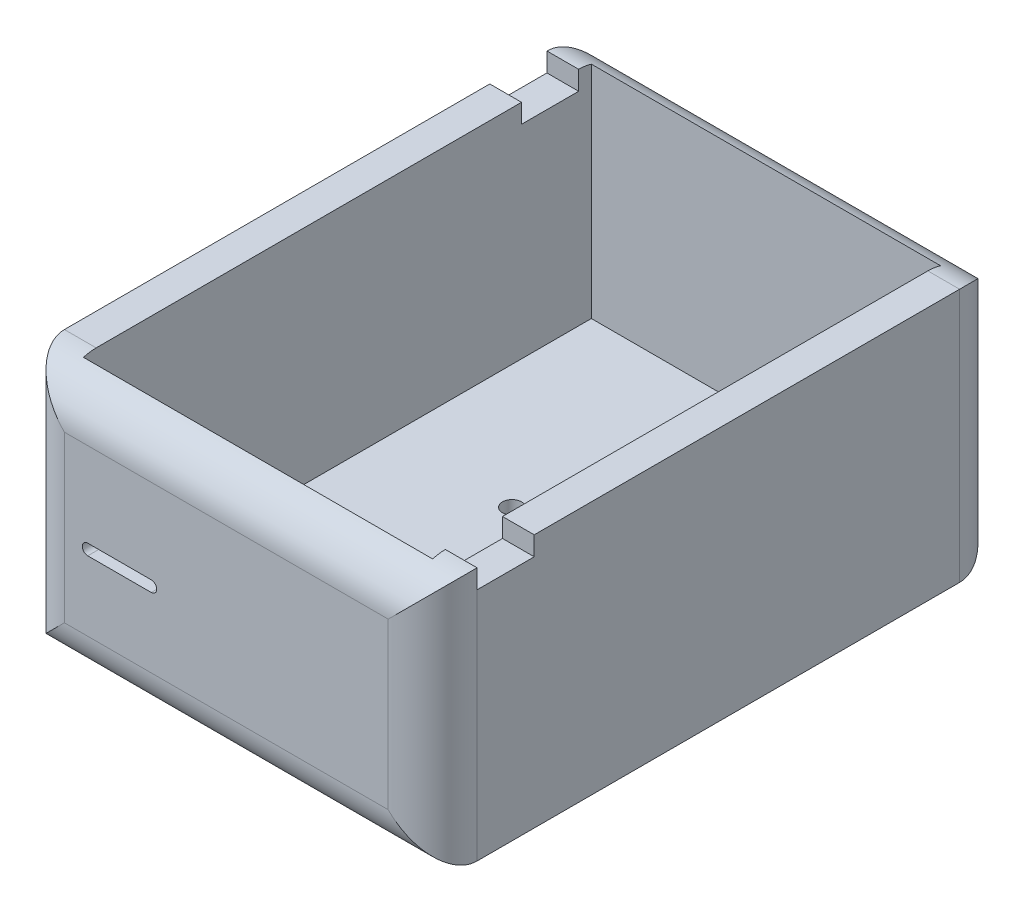
ISO-10303-21;
HEADER;
FILE_DESCRIPTION(('STEP AP214'),'2;1');
FILE_NAME('part.step','',(''),(''),'','','');
FILE_SCHEMA(('AUTOMOTIVE_DESIGN { 1 0 10303 214 1 1 1 1 }'));
ENDSEC;
DATA;
#1=APPLICATION_CONTEXT('core data for automotive mechanical design processes');
#2=APPLICATION_PROTOCOL_DEFINITION('international standard','automotive_design',2000,#1);
#3=PRODUCT_CONTEXT('',#1,'mechanical');
#4=PRODUCT('Part','Part','',(#3));
#5=PRODUCT_RELATED_PRODUCT_CATEGORY('part','',(#4));
#6=PRODUCT_DEFINITION_FORMATION('','',#4);
#7=PRODUCT_DEFINITION_CONTEXT('part definition',#1,'design');
#8=PRODUCT_DEFINITION('design','',#6,#7);
#9=PRODUCT_DEFINITION_SHAPE('','',#8);
#10=(LENGTH_UNIT() NAMED_UNIT(*) SI_UNIT(.MILLI.,.METRE.));
#11=(NAMED_UNIT(*) PLANE_ANGLE_UNIT() SI_UNIT($,.RADIAN.));
#12=(NAMED_UNIT(*) SI_UNIT($,.STERADIAN.) SOLID_ANGLE_UNIT());
#13=UNCERTAINTY_MEASURE_WITH_UNIT(LENGTH_MEASURE(1.E-05),#10,'distance_accuracy_value','');
#14=(GEOMETRIC_REPRESENTATION_CONTEXT(3) GLOBAL_UNCERTAINTY_ASSIGNED_CONTEXT((#13)) GLOBAL_UNIT_ASSIGNED_CONTEXT((#10,
#11,#12)) REPRESENTATION_CONTEXT('',''));
#15=CARTESIAN_POINT('',(0.,0.,0.));
#16=DIRECTION('',(0.,0.,1.));
#17=DIRECTION('',(1.,0.,0.));
#18=AXIS2_PLACEMENT_3D('',#15,#16,#17);
#19=CARTESIAN_POINT('',(0.,40.,0.));
#20=DIRECTION('',(0.,-1.,0.));
#21=DIRECTION('',(0.,0.,-1.));
#22=AXIS2_PLACEMENT_3D('',#19,#20,#21);
#23=PLANE('',#22);
#24=DIRECTION('',(0.,0.,-1.));
#25=VECTOR('',#24,1.);
#26=CARTESIAN_POINT('',(27.5,40.,0.));
#27=LINE('',#26,#25);
#28=CARTESIAN_POINT('',(27.5,40.,29.));
#29=VERTEX_POINT('',#28);
#30=CARTESIAN_POINT('',(27.5,40.,-38.));
#31=VERTEX_POINT('',#30);
#32=EDGE_CURVE('E321',#29,#31,#27,.T.);
#33=ORIENTED_EDGE('',*,*,#32,.F.);
#34=DIRECTION('',(-1.,0.,0.));
#35=VECTOR('',#34,1.);
#36=CARTESIAN_POINT('',(27.5,40.,29.));
#37=LINE('',#36,#35);
#38=CARTESIAN_POINT('',(32.5,40.,29.));
#39=VERTEX_POINT('',#38);
#40=EDGE_CURVE('E233',#39,#29,#37,.T.);
#41=ORIENTED_EDGE('',*,*,#40,.F.);
#42=DIRECTION('',(0.,0.,-1.));
#43=VECTOR('',#42,1.);
#44=CARTESIAN_POINT('',(32.5,40.,45.));
#45=LINE('',#44,#43);
#46=CARTESIAN_POINT('',(32.5,40.,-38.));
#47=VERTEX_POINT('',#46);
#48=EDGE_CURVE('E324',#39,#47,#45,.T.);
#49=ORIENTED_EDGE('',*,*,#48,.T.);
#50=DIRECTION('',(-1.,0.,0.));
#51=VECTOR('',#50,1.);
#52=CARTESIAN_POINT('',(0.,40.,-38.));
#53=LINE('',#52,#51);
#54=EDGE_CURVE('E355',#47,#31,#53,.T.);
#55=ORIENTED_EDGE('',*,*,#54,.T.);
#56=EDGE_LOOP('',(#33,#41,#49,#55));
#57=FACE_BOUND('',#56,.T.);
#58=ADVANCED_FACE('F35',(#57),#23,.F.);
#59=DIRECTION('',(0.,0.,1.));
#60=VECTOR('',#59,1.);
#61=CARTESIAN_POINT('',(-27.5,40.,0.));
#62=LINE('',#61,#60);
#63=CARTESIAN_POINT('',(-27.5,40.,-29.));
#64=VERTEX_POINT('',#63);
#65=CARTESIAN_POINT('',(-27.5,40.,38.));
#66=VERTEX_POINT('',#65);
#67=EDGE_CURVE('E310',#64,#66,#62,.T.);
#68=ORIENTED_EDGE('',*,*,#67,.F.);
#69=DIRECTION('',(1.,0.,0.));
#70=VECTOR('',#69,1.);
#71=CARTESIAN_POINT('',(-32.5,40.,-29.));
#72=LINE('',#71,#70);
#73=CARTESIAN_POINT('',(-32.5,40.,-29.));
#74=VERTEX_POINT('',#73);
#75=EDGE_CURVE('E250',#74,#64,#72,.T.);
#76=ORIENTED_EDGE('',*,*,#75,.F.);
#77=DIRECTION('',(0.,0.,1.));
#78=VECTOR('',#77,1.);
#79=CARTESIAN_POINT('',(-32.5,40.,45.));
#80=LINE('',#79,#78);
#81=CARTESIAN_POINT('',(-32.5,40.,38.));
#82=VERTEX_POINT('',#81);
#83=EDGE_CURVE('E326',#74,#82,#80,.T.);
#84=ORIENTED_EDGE('',*,*,#83,.T.);
#85=DIRECTION('',(1.,0.,0.));
#86=VECTOR('',#85,1.);
#87=CARTESIAN_POINT('',(0.,40.,38.));
#88=LINE('',#87,#86);
#89=EDGE_CURVE('E350',#82,#66,#88,.T.);
#90=ORIENTED_EDGE('',*,*,#89,.T.);
#91=EDGE_LOOP('',(#68,#76,#84,#90));
#92=FACE_BOUND('',#91,.T.);
#93=ADVANCED_FACE('F493',(#92),#23,.F.);
#94=CARTESIAN_POINT('',(32.5,40.,45.));
#95=DIRECTION('',(-1.,0.,0.));
#96=DIRECTION('',(0.,0.,1.));
#97=AXIS2_PLACEMENT_3D('',#94,#95,#96);
#98=PLANE('',#97);
#99=ORIENTED_EDGE('',*,*,#48,.F.);
#100=DIRECTION('',(0.,1.,0.));
#101=VECTOR('',#100,1.);
#102=CARTESIAN_POINT('',(32.5,37.,29.));
#103=LINE('',#102,#101);
#104=CARTESIAN_POINT('',(32.5,37.,29.));
#105=VERTEX_POINT('',#104);
#106=EDGE_CURVE('E251',#105,#39,#103,.T.);
#107=ORIENTED_EDGE('',*,*,#106,.F.);
#108=DIRECTION('',(0.,0.,-1.));
#109=VECTOR('',#108,1.);
#110=CARTESIAN_POINT('',(32.5,37.,38.));
#111=LINE('',#110,#109);
#112=CARTESIAN_POINT('',(32.5,37.,38.));
#113=VERTEX_POINT('',#112);
#114=EDGE_CURVE('E240',#113,#105,#111,.T.);
#115=ORIENTED_EDGE('',*,*,#114,.F.);
#116=DIRECTION('',(0.,-1.,0.));
#117=VECTOR('',#116,1.);
#118=CARTESIAN_POINT('',(32.5,40.,38.));
#119=LINE('',#118,#117);
#120=CARTESIAN_POINT('',(32.5,0.,38.));
#121=VERTEX_POINT('',#120);
#122=EDGE_CURVE('E342',#113,#121,#119,.T.);
#123=ORIENTED_EDGE('',*,*,#122,.T.);
#124=DIRECTION('',(0.,0.,-1.));
#125=VECTOR('',#124,1.);
#126=CARTESIAN_POINT('',(32.5,0.,45.));
#127=LINE('',#126,#125);
#128=CARTESIAN_POINT('',(32.5,0.,-38.));
#129=VERTEX_POINT('',#128);
#130=EDGE_CURVE('E305',#121,#129,#127,.T.);
#131=ORIENTED_EDGE('',*,*,#130,.T.);
#132=DIRECTION('',(0.,-1.,0.));
#133=VECTOR('',#132,1.);
#134=CARTESIAN_POINT('',(32.5,40.,-38.));
#135=LINE('',#134,#133);
#136=EDGE_CURVE('E345',#129,#47,#135,.F.);
#137=ORIENTED_EDGE('',*,*,#136,.T.);
#138=EDGE_LOOP('',(#99,#107,#115,#123,#131,#137));
#139=FACE_BOUND('',#138,.T.);
#140=ADVANCED_FACE('F431',(#139),#98,.F.);
#141=CARTESIAN_POINT('',(-32.5,40.,-45.));
#142=DIRECTION('',(0.,0.,1.));
#143=DIRECTION('',(1.,0.,0.));
#144=AXIS2_PLACEMENT_3D('',#141,#142,#143);
#145=PLANE('',#144);
#146=DIRECTION('',(-1.,0.,0.));
#147=VECTOR('',#146,1.);
#148=CARTESIAN_POINT('',(-32.5,33.,-45.));
#149=LINE('',#148,#147);
#150=CARTESIAN_POINT('',(-25.5,33.,-45.));
#151=VERTEX_POINT('',#150);
#152=CARTESIAN_POINT('',(25.5,33.,-45.));
#153=VERTEX_POINT('',#152);
#154=EDGE_CURVE('E337',#151,#153,#149,.F.);
#155=ORIENTED_EDGE('',*,*,#154,.T.);
#156=DIRECTION('',(0.,-1.,0.));
#157=VECTOR('',#156,1.);
#158=CARTESIAN_POINT('',(25.5,40.,-45.));
#159=LINE('',#158,#157);
#160=CARTESIAN_POINT('',(25.5,7.,-45.));
#161=VERTEX_POINT('',#160);
#162=EDGE_CURVE('E339',#153,#161,#159,.T.);
#163=ORIENTED_EDGE('',*,*,#162,.T.);
#164=DIRECTION('',(-1.,0.,0.));
#165=VECTOR('',#164,1.);
#166=CARTESIAN_POINT('',(-32.5,7.,-45.));
#167=LINE('',#166,#165);
#168=CARTESIAN_POINT('',(-25.5,7.,-45.));
#169=VERTEX_POINT('',#168);
#170=EDGE_CURVE('E329',#161,#169,#167,.T.);
#171=ORIENTED_EDGE('',*,*,#170,.T.);
#172=DIRECTION('',(0.,-1.,0.));
#173=VECTOR('',#172,1.);
#174=CARTESIAN_POINT('',(-25.5,40.,-45.));
#175=LINE('',#174,#173);
#176=EDGE_CURVE('E335',#169,#151,#175,.F.);
#177=ORIENTED_EDGE('',*,*,#176,.T.);
#178=EDGE_LOOP('',(#155,#163,#171,#177));
#179=FACE_BOUND('',#178,.T.);
#180=ADVANCED_FACE('F526',(#179),#145,.F.);
#181=CARTESIAN_POINT('',(-32.5,40.,45.));
#182=DIRECTION('',(1.,0.,0.));
#183=DIRECTION('',(0.,0.,-1.));
#184=AXIS2_PLACEMENT_3D('',#181,#182,#183);
#185=PLANE('',#184);
#186=ORIENTED_EDGE('',*,*,#83,.F.);
#187=DIRECTION('',(0.,1.,0.));
#188=VECTOR('',#187,1.);
#189=CARTESIAN_POINT('',(-32.5,37.,-29.));
#190=LINE('',#189,#188);
#191=CARTESIAN_POINT('',(-32.5,37.,-29.));
#192=VERTEX_POINT('',#191);
#193=EDGE_CURVE('E265',#192,#74,#190,.T.);
#194=ORIENTED_EDGE('',*,*,#193,.F.);
#195=DIRECTION('',(0.,0.,1.));
#196=VECTOR('',#195,1.);
#197=CARTESIAN_POINT('',(-32.5,37.,-37.9999999999999));
#198=LINE('',#197,#196);
#199=CARTESIAN_POINT('',(-32.5,37.,-37.9999999999999));
#200=VERTEX_POINT('',#199);
#201=EDGE_CURVE('E254',#200,#192,#198,.T.);
#202=ORIENTED_EDGE('',*,*,#201,.F.);
#203=DIRECTION('',(0.,-1.,0.));
#204=VECTOR('',#203,1.);
#205=CARTESIAN_POINT('',(-32.5,40.,-38.));
#206=LINE('',#205,#204);
#207=CARTESIAN_POINT('',(-32.5,0.,-38.));
#208=VERTEX_POINT('',#207);
#209=EDGE_CURVE('E373',#200,#208,#206,.T.);
#210=ORIENTED_EDGE('',*,*,#209,.T.);
#211=DIRECTION('',(0.,0.,1.));
#212=VECTOR('',#211,1.);
#213=CARTESIAN_POINT('',(-32.5,0.,45.));
#214=LINE('',#213,#212);
#215=CARTESIAN_POINT('',(-32.5,0.,38.));
#216=VERTEX_POINT('',#215);
#217=EDGE_CURVE('E327',#208,#216,#214,.T.);
#218=ORIENTED_EDGE('',*,*,#217,.T.);
#219=DIRECTION('',(0.,-1.,0.));
#220=VECTOR('',#219,1.);
#221=CARTESIAN_POINT('',(-32.5,40.,38.));
#222=LINE('',#221,#220);
#223=EDGE_CURVE('E370',#216,#82,#222,.F.);
#224=ORIENTED_EDGE('',*,*,#223,.T.);
#225=EDGE_LOOP('',(#186,#194,#202,#210,#218,#224));
#226=FACE_BOUND('',#225,.T.);
#227=ADVANCED_FACE('F480',(#226),#185,.F.);
#228=CARTESIAN_POINT('',(-32.5,40.,45.));
#229=DIRECTION('',(0.,0.,-1.));
#230=DIRECTION('',(-1.,0.,0.));
#231=AXIS2_PLACEMENT_3D('',#228,#229,#230);
#232=PLANE('',#231);
#233=CARTESIAN_POINT('',(-11.8264162000096,18.8353493332014,45.));
#234=DIRECTION('',(0.,0.,1.));
#235=DIRECTION('',(1.,0.,0.));
#236=AXIS2_PLACEMENT_3D('',#233,#234,#235);
#237=CIRCLE('',#236,0.862704197628836);
#238=CARTESIAN_POINT('',(-11.8264162000096,17.9726451355726,45.));
#239=VERTEX_POINT('',#238);
#240=CARTESIAN_POINT('',(-11.8264162000096,19.6980535308302,45.));
#241=VERTEX_POINT('',#240);
#242=EDGE_CURVE('E212',#239,#241,#237,.T.);
#243=ORIENTED_EDGE('',*,*,#242,.F.);
#244=DIRECTION('',(1.,0.,0.));
#245=VECTOR('',#244,1.);
#246=CARTESIAN_POINT('',(-21.8264162000096,17.9726451355726,45.));
#247=LINE('',#246,#245);
#248=CARTESIAN_POINT('',(-21.8264162000096,17.9726451355726,45.));
#249=VERTEX_POINT('',#248);
#250=EDGE_CURVE('E224',#249,#239,#247,.T.);
#251=ORIENTED_EDGE('',*,*,#250,.F.);
#252=CARTESIAN_POINT('',(-21.8264162000096,18.8353493332014,45.));
#253=DIRECTION('',(0.,0.,1.));
#254=DIRECTION('',(1.,0.,0.));
#255=AXIS2_PLACEMENT_3D('',#252,#253,#254);
#256=CIRCLE('',#255,0.862704197628836);
#257=CARTESIAN_POINT('',(-21.8264162000096,19.6980535308302,45.));
#258=VERTEX_POINT('',#257);
#259=EDGE_CURVE('E222',#258,#249,#256,.T.);
#260=ORIENTED_EDGE('',*,*,#259,.F.);
#261=DIRECTION('',(-1.,0.,0.));
#262=VECTOR('',#261,1.);
#263=CARTESIAN_POINT('',(-21.8264162000096,19.6980535308302,45.));
#264=LINE('',#263,#262);
#265=EDGE_CURVE('E52',#241,#258,#264,.T.);
#266=ORIENTED_EDGE('',*,*,#265,.F.);
#267=EDGE_LOOP('',(#243,#251,#260,#266));
#268=FACE_BOUND('',#267,.T.);
#269=DIRECTION('',(1.,0.,0.));
#270=VECTOR('',#269,1.);
#271=CARTESIAN_POINT('',(-32.5,33.,45.));
#272=LINE('',#271,#270);
#273=CARTESIAN_POINT('',(25.5,33.,45.));
#274=VERTEX_POINT('',#273);
#275=CARTESIAN_POINT('',(-25.5,33.,45.));
#276=VERTEX_POINT('',#275);
#277=EDGE_CURVE('E384',#274,#276,#272,.F.);
#278=ORIENTED_EDGE('',*,*,#277,.T.);
#279=DIRECTION('',(0.,-1.,0.));
#280=VECTOR('',#279,1.);
#281=CARTESIAN_POINT('',(-25.5,40.,45.));
#282=LINE('',#281,#280);
#283=CARTESIAN_POINT('',(-25.5,7.,45.));
#284=VERTEX_POINT('',#283);
#285=EDGE_CURVE('E44',#276,#284,#282,.T.);
#286=ORIENTED_EDGE('',*,*,#285,.T.);
#287=DIRECTION('',(1.,0.,0.));
#288=VECTOR('',#287,1.);
#289=CARTESIAN_POINT('',(32.5,7.,45.));
#290=LINE('',#289,#288);
#291=CARTESIAN_POINT('',(25.5,7.,45.));
#292=VERTEX_POINT('',#291);
#293=EDGE_CURVE('E380',#284,#292,#290,.T.);
#294=ORIENTED_EDGE('',*,*,#293,.T.);
#295=DIRECTION('',(0.,-1.,0.));
#296=VECTOR('',#295,1.);
#297=CARTESIAN_POINT('',(25.5,40.,45.));
#298=LINE('',#297,#296);
#299=EDGE_CURVE('E382',#292,#274,#298,.F.);
#300=ORIENTED_EDGE('',*,*,#299,.T.);
#301=EDGE_LOOP('',(#278,#286,#294,#300));
#302=FACE_BOUND('',#301,.T.);
#303=ADVANCED_FACE('F519',(#268,#302),#232,.F.);
#304=CARTESIAN_POINT('',(0.,0.,0.));
#305=DIRECTION('',(0.,-1.,0.));
#306=DIRECTION('',(0.,0.,-1.));
#307=AXIS2_PLACEMENT_3D('',#304,#305,#306);
#308=PLANE('',#307);
#309=CARTESIAN_POINT('',(-7.99999999999999,0.,8.));
#310=DIRECTION('',(0.,-1.,0.));
#311=DIRECTION('',(0.,0.,-1.));
#312=AXIS2_PLACEMENT_3D('',#309,#310,#311);
#313=CIRCLE('',#312,1.5);
#314=CARTESIAN_POINT('',(-7.99999999999999,0.,6.5));
#315=VERTEX_POINT('',#314);
#316=EDGE_CURVE('E277',#315,#315,#313,.T.);
#317=ORIENTED_EDGE('',*,*,#316,.F.);
#318=EDGE_LOOP('',(#317));
#319=FACE_BOUND('',#318,.T.);
#320=CARTESIAN_POINT('',(8.,0.,8.));
#321=DIRECTION('',(0.,-1.,0.));
#322=DIRECTION('',(0.,0.,-1.));
#323=AXIS2_PLACEMENT_3D('',#320,#321,#322);
#324=CIRCLE('',#323,1.5);
#325=CARTESIAN_POINT('',(8.,0.,6.5));
#326=VERTEX_POINT('',#325);
#327=EDGE_CURVE('E284',#326,#326,#324,.T.);
#328=ORIENTED_EDGE('',*,*,#327,.F.);
#329=EDGE_LOOP('',(#328));
#330=FACE_BOUND('',#329,.T.);
#331=CARTESIAN_POINT('',(8.,0.,-8.));
#332=DIRECTION('',(0.,-1.,0.));
#333=DIRECTION('',(0.,0.,-1.));
#334=AXIS2_PLACEMENT_3D('',#331,#332,#333);
#335=CIRCLE('',#334,1.5);
#336=CARTESIAN_POINT('',(8.,0.,-9.5));
#337=VERTEX_POINT('',#336);
#338=EDGE_CURVE('E290',#337,#337,#335,.T.);
#339=ORIENTED_EDGE('',*,*,#338,.F.);
#340=EDGE_LOOP('',(#339));
#341=FACE_BOUND('',#340,.T.);
#342=CARTESIAN_POINT('',(-8.,0.,-8.));
#343=DIRECTION('',(0.,-1.,0.));
#344=DIRECTION('',(0.,0.,-1.));
#345=AXIS2_PLACEMENT_3D('',#342,#343,#344);
#346=CIRCLE('',#345,1.5);
#347=CARTESIAN_POINT('',(-8.,0.,-9.5));
#348=VERTEX_POINT('',#347);
#349=EDGE_CURVE('E296',#348,#348,#346,.T.);
#350=ORIENTED_EDGE('',*,*,#349,.F.);
#351=EDGE_LOOP('',(#350));
#352=FACE_BOUND('',#351,.T.);
#353=ORIENTED_EDGE('',*,*,#217,.F.);
#354=DIRECTION('',(-1.,0.,0.));
#355=VECTOR('',#354,1.);
#356=CARTESIAN_POINT('',(32.5,0.,-38.));
#357=LINE('',#356,#355);
#358=EDGE_CURVE('E378',#208,#129,#357,.F.);
#359=ORIENTED_EDGE('',*,*,#358,.T.);
#360=ORIENTED_EDGE('',*,*,#130,.F.);
#361=DIRECTION('',(1.,0.,0.));
#362=VECTOR('',#361,1.);
#363=CARTESIAN_POINT('',(-32.5,0.,38.));
#364=LINE('',#363,#362);
#365=EDGE_CURVE('E376',#121,#216,#364,.F.);
#366=ORIENTED_EDGE('',*,*,#365,.T.);
#367=EDGE_LOOP('',(#353,#359,#360,#366));
#368=FACE_BOUND('',#367,.T.);
#369=ADVANCED_FACE('F484',(#319,#330,#341,#352,#368),#308,.T.);
#370=CARTESIAN_POINT('',(27.5,40.,45.));
#371=DIRECTION('',(-1.,0.,0.));
#372=DIRECTION('',(0.,0.,1.));
#373=AXIS2_PLACEMENT_3D('',#370,#371,#372);
#374=PLANE('',#373);
#375=DIRECTION('',(0.,1.,0.));
#376=VECTOR('',#375,1.);
#377=CARTESIAN_POINT('',(27.5,37.,29.));
#378=LINE('',#377,#376);
#379=CARTESIAN_POINT('',(27.5,37.,29.));
#380=VERTEX_POINT('',#379);
#381=EDGE_CURVE('E247',#380,#29,#378,.T.);
#382=ORIENTED_EDGE('',*,*,#381,.T.);
#383=ORIENTED_EDGE('',*,*,#32,.T.);
#384=CARTESIAN_POINT('',(27.5,33.,-38.));
#385=DIRECTION('',(-1.,0.,0.));
#386=DIRECTION('',(0.,0.,1.));
#387=AXIS2_PLACEMENT_3D('',#384,#385,#386);
#388=CIRCLE('',#387,7.);
#389=CARTESIAN_POINT('',(27.5,39.7082039324994,-40.));
#390=VERTEX_POINT('',#389);
#391=EDGE_CURVE('E361',#31,#390,#388,.T.);
#392=ORIENTED_EDGE('',*,*,#391,.T.);
#393=DIRECTION('',(0.,-1.,0.));
#394=VECTOR('',#393,1.);
#395=CARTESIAN_POINT('',(27.5,40.,-40.));
#396=LINE('',#395,#394);
#397=CARTESIAN_POINT('',(27.5,5.,-40.));
#398=VERTEX_POINT('',#397);
#399=EDGE_CURVE('E303',#390,#398,#396,.T.);
#400=ORIENTED_EDGE('',*,*,#399,.T.);
#401=DIRECTION('',(0.,0.,-1.));
#402=VECTOR('',#401,1.);
#403=CARTESIAN_POINT('',(27.5,5.,0.));
#404=LINE('',#403,#402);
#405=CARTESIAN_POINT('',(27.5,5.,40.));
#406=VERTEX_POINT('',#405);
#407=EDGE_CURVE('E299',#406,#398,#404,.T.);
#408=ORIENTED_EDGE('',*,*,#407,.F.);
#409=DIRECTION('',(0.,-1.,0.));
#410=VECTOR('',#409,1.);
#411=CARTESIAN_POINT('',(27.5,40.,40.));
#412=LINE('',#411,#410);
#413=CARTESIAN_POINT('',(27.5,39.7082039324994,40.));
#414=VERTEX_POINT('',#413);
#415=EDGE_CURVE('E307',#414,#406,#412,.T.);
#416=ORIENTED_EDGE('',*,*,#415,.F.);
#417=CARTESIAN_POINT('',(27.5,33.,38.));
#418=DIRECTION('',(-1.,0.,0.));
#419=DIRECTION('',(0.,0.,1.));
#420=AXIS2_PLACEMENT_3D('',#417,#418,#419);
#421=CIRCLE('',#420,7.);
#422=CARTESIAN_POINT('',(27.5,40.,38.));
#423=VERTEX_POINT('',#422);
#424=EDGE_CURVE('E358',#414,#423,#421,.T.);
#425=ORIENTED_EDGE('',*,*,#424,.T.);
#426=DIRECTION('',(0.,1.,0.));
#427=VECTOR('',#426,1.);
#428=CARTESIAN_POINT('',(27.5,37.,38.));
#429=LINE('',#428,#427);
#430=CARTESIAN_POINT('',(27.5,37.,38.));
#431=VERTEX_POINT('',#430);
#432=EDGE_CURVE('E245',#431,#423,#429,.T.);
#433=ORIENTED_EDGE('',*,*,#432,.F.);
#434=DIRECTION('',(0.,0.,1.));
#435=VECTOR('',#434,1.);
#436=CARTESIAN_POINT('',(27.5,37.,38.));
#437=LINE('',#436,#435);
#438=EDGE_CURVE('E234',#380,#431,#437,.T.);
#439=ORIENTED_EDGE('',*,*,#438,.F.);
#440=EDGE_LOOP('',(#382,#383,#392,#400,#408,#416,#425,#433,#439));
#441=FACE_BOUND('',#440,.T.);
#442=ADVANCED_FACE('F441',(#441),#374,.T.);
#443=CARTESIAN_POINT('',(-32.5,40.,-40.));
#444=DIRECTION('',(0.,0.,1.));
#445=DIRECTION('',(1.,0.,0.));
#446=AXIS2_PLACEMENT_3D('',#443,#444,#445);
#447=PLANE('',#446);
#448=ORIENTED_EDGE('',*,*,#399,.F.);
#449=DIRECTION('',(-1.,0.,0.));
#450=VECTOR('',#449,1.);
#451=CARTESIAN_POINT('',(27.5,39.7082039324994,-40.));
#452=LINE('',#451,#450);
#453=CARTESIAN_POINT('',(-27.5,39.7082039324994,-40.));
#454=VERTEX_POINT('',#453);
#455=EDGE_CURVE('E363',#390,#454,#452,.T.);
#456=ORIENTED_EDGE('',*,*,#455,.T.);
#457=DIRECTION('',(0.,-1.,0.));
#458=VECTOR('',#457,1.);
#459=CARTESIAN_POINT('',(-27.5,40.,-40.));
#460=LINE('',#459,#458);
#461=CARTESIAN_POINT('',(-27.5,5.,-40.));
#462=VERTEX_POINT('',#461);
#463=EDGE_CURVE('E306',#454,#462,#460,.T.);
#464=ORIENTED_EDGE('',*,*,#463,.T.);
#465=DIRECTION('',(-1.,0.,0.));
#466=VECTOR('',#465,1.);
#467=CARTESIAN_POINT('',(0.,5.,-40.));
#468=LINE('',#467,#466);
#469=EDGE_CURVE('E302',#398,#462,#468,.T.);
#470=ORIENTED_EDGE('',*,*,#469,.F.);
#471=EDGE_LOOP('',(#448,#456,#464,#470));
#472=FACE_BOUND('',#471,.T.);
#473=ADVANCED_FACE('F458',(#472),#447,.T.);
#474=CARTESIAN_POINT('',(-27.5,40.,45.));
#475=DIRECTION('',(1.,0.,0.));
#476=DIRECTION('',(0.,0.,-1.));
#477=AXIS2_PLACEMENT_3D('',#474,#475,#476);
#478=PLANE('',#477);
#479=DIRECTION('',(0.,1.,0.));
#480=VECTOR('',#479,1.);
#481=CARTESIAN_POINT('',(-27.5,37.,-37.9999999999999));
#482=LINE('',#481,#480);
#483=CARTESIAN_POINT('',(-27.5,37.,-37.9999999999999));
#484=VERTEX_POINT('',#483);
#485=CARTESIAN_POINT('',(-27.5,40.,-38.));
#486=VERTEX_POINT('',#485);
#487=EDGE_CURVE('E267',#484,#486,#482,.T.);
#488=ORIENTED_EDGE('',*,*,#487,.F.);
#489=DIRECTION('',(0.,0.,-1.));
#490=VECTOR('',#489,1.);
#491=CARTESIAN_POINT('',(-27.5,37.,-37.9999999999999));
#492=LINE('',#491,#490);
#493=CARTESIAN_POINT('',(-27.5,37.,-29.));
#494=VERTEX_POINT('',#493);
#495=EDGE_CURVE('E260',#494,#484,#492,.T.);
#496=ORIENTED_EDGE('',*,*,#495,.F.);
#497=DIRECTION('',(0.,1.,0.));
#498=VECTOR('',#497,1.);
#499=CARTESIAN_POINT('',(-27.5,37.,-29.));
#500=LINE('',#499,#498);
#501=EDGE_CURVE('E270',#494,#64,#500,.T.);
#502=ORIENTED_EDGE('',*,*,#501,.T.);
#503=ORIENTED_EDGE('',*,*,#67,.T.);
#504=CARTESIAN_POINT('',(-27.5,33.,38.));
#505=DIRECTION('',(1.,0.,0.));
#506=DIRECTION('',(0.,0.,-1.));
#507=AXIS2_PLACEMENT_3D('',#504,#505,#506);
#508=CIRCLE('',#507,7.);
#509=CARTESIAN_POINT('',(-27.5,39.7082039324994,40.));
#510=VERTEX_POINT('',#509);
#511=EDGE_CURVE('E365',#66,#510,#508,.T.);
#512=ORIENTED_EDGE('',*,*,#511,.T.);
#513=DIRECTION('',(0.,-1.,0.));
#514=VECTOR('',#513,1.);
#515=CARTESIAN_POINT('',(-27.5,40.,40.));
#516=LINE('',#515,#514);
#517=CARTESIAN_POINT('',(-27.5,5.,40.));
#518=VERTEX_POINT('',#517);
#519=EDGE_CURVE('E309',#510,#518,#516,.T.);
#520=ORIENTED_EDGE('',*,*,#519,.T.);
#521=DIRECTION('',(0.,0.,1.));
#522=VECTOR('',#521,1.);
#523=CARTESIAN_POINT('',(-27.5,5.,0.));
#524=LINE('',#523,#522);
#525=EDGE_CURVE('E313',#462,#518,#524,.T.);
#526=ORIENTED_EDGE('',*,*,#525,.F.);
#527=ORIENTED_EDGE('',*,*,#463,.F.);
#528=CARTESIAN_POINT('',(-27.5,33.,-38.));
#529=DIRECTION('',(1.,0.,0.));
#530=DIRECTION('',(0.,0.,-1.));
#531=AXIS2_PLACEMENT_3D('',#528,#529,#530);
#532=CIRCLE('',#531,7.);
#533=EDGE_CURVE('E367',#454,#486,#532,.T.);
#534=ORIENTED_EDGE('',*,*,#533,.T.);
#535=EDGE_LOOP('',(#488,#496,#502,#503,#512,#520,#526,#527,#534));
#536=FACE_BOUND('',#535,.T.);
#537=ADVANCED_FACE('F452',(#536),#478,.T.);
#538=CARTESIAN_POINT('',(-32.5,40.,40.));
#539=DIRECTION('',(0.,0.,-1.));
#540=DIRECTION('',(-1.,0.,0.));
#541=AXIS2_PLACEMENT_3D('',#538,#539,#540);
#542=PLANE('',#541);
#543=DIRECTION('',(1.,0.,0.));
#544=VECTOR('',#543,1.);
#545=CARTESIAN_POINT('',(-21.8264162000096,17.9726451355726,40.));
#546=LINE('',#545,#544);
#547=CARTESIAN_POINT('',(-21.8264162000096,17.9726451355726,40.));
#548=VERTEX_POINT('',#547);
#549=CARTESIAN_POINT('',(-11.8264162000096,17.9726451355726,40.));
#550=VERTEX_POINT('',#549);
#551=EDGE_CURVE('E218',#548,#550,#546,.T.);
#552=ORIENTED_EDGE('',*,*,#551,.T.);
#553=CARTESIAN_POINT('',(-11.8264162000096,18.8353493332014,40.));
#554=DIRECTION('',(0.,0.,-1.));
#555=DIRECTION('',(-1.,0.,0.));
#556=AXIS2_PLACEMENT_3D('',#553,#554,#555);
#557=CIRCLE('',#556,0.862704197628836);
#558=CARTESIAN_POINT('',(-11.8264162000096,19.6980535308302,40.));
#559=VERTEX_POINT('',#558);
#560=EDGE_CURVE('E206',#550,#559,#557,.F.);
#561=ORIENTED_EDGE('',*,*,#560,.T.);
#562=DIRECTION('',(-1.,0.,0.));
#563=VECTOR('',#562,1.);
#564=CARTESIAN_POINT('',(-21.8264162000096,19.6980535308302,40.));
#565=LINE('',#564,#563);
#566=CARTESIAN_POINT('',(-21.8264162000096,19.6980535308302,40.));
#567=VERTEX_POINT('',#566);
#568=EDGE_CURVE('E196',#559,#567,#565,.T.);
#569=ORIENTED_EDGE('',*,*,#568,.T.);
#570=CARTESIAN_POINT('',(-21.8264162000096,18.8353493332014,40.));
#571=DIRECTION('',(0.,0.,-1.));
#572=DIRECTION('',(-1.,0.,0.));
#573=AXIS2_PLACEMENT_3D('',#570,#571,#572);
#574=CIRCLE('',#573,0.862704197628836);
#575=EDGE_CURVE('E205',#567,#548,#574,.F.);
#576=ORIENTED_EDGE('',*,*,#575,.T.);
#577=EDGE_LOOP('',(#552,#561,#569,#576));
#578=FACE_BOUND('',#577,.T.);
#579=ORIENTED_EDGE('',*,*,#519,.F.);
#580=DIRECTION('',(1.,0.,0.));
#581=VECTOR('',#580,1.);
#582=CARTESIAN_POINT('',(-27.5,39.7082039324994,40.));
#583=LINE('',#582,#581);
#584=EDGE_CURVE('E11',#510,#414,#583,.T.);
#585=ORIENTED_EDGE('',*,*,#584,.T.);
#586=ORIENTED_EDGE('',*,*,#415,.T.);
#587=DIRECTION('',(1.,0.,0.));
#588=VECTOR('',#587,1.);
#589=CARTESIAN_POINT('',(0.,5.,40.));
#590=LINE('',#589,#588);
#591=EDGE_CURVE('E317',#518,#406,#590,.T.);
#592=ORIENTED_EDGE('',*,*,#591,.F.);
#593=EDGE_LOOP('',(#579,#585,#586,#592));
#594=FACE_BOUND('',#593,.T.);
#595=ADVANCED_FACE('F216',(#578,#594),#542,.T.);
#596=CARTESIAN_POINT('',(0.,5.,0.));
#597=DIRECTION('',(0.,-1.,0.));
#598=DIRECTION('',(0.,0.,-1.));
#599=AXIS2_PLACEMENT_3D('',#596,#597,#598);
#600=PLANE('',#599);
#601=CARTESIAN_POINT('',(-7.99999999999999,5.,8.));
#602=DIRECTION('',(0.,1.,0.));
#603=DIRECTION('',(0.,0.,-1.));
#604=AXIS2_PLACEMENT_3D('',#601,#602,#603);
#605=CIRCLE('',#604,1.5);
#606=CARTESIAN_POINT('',(-7.99999999999999,5.,6.5));
#607=VERTEX_POINT('',#606);
#608=EDGE_CURVE('E274',#607,#607,#605,.T.);
#609=ORIENTED_EDGE('',*,*,#608,.F.);
#610=EDGE_LOOP('',(#609));
#611=FACE_BOUND('',#610,.T.);
#612=CARTESIAN_POINT('',(8.,5.,8.));
#613=DIRECTION('',(0.,1.,0.));
#614=DIRECTION('',(0.,0.,1.));
#615=AXIS2_PLACEMENT_3D('',#612,#613,#614);
#616=CIRCLE('',#615,1.5);
#617=CARTESIAN_POINT('',(8.,5.,9.5));
#618=VERTEX_POINT('',#617);
#619=EDGE_CURVE('E281',#618,#618,#616,.T.);
#620=ORIENTED_EDGE('',*,*,#619,.F.);
#621=EDGE_LOOP('',(#620));
#622=FACE_BOUND('',#621,.T.);
#623=CARTESIAN_POINT('',(8.,5.,-8.));
#624=DIRECTION('',(0.,1.,0.));
#625=DIRECTION('',(0.,0.,-1.));
#626=AXIS2_PLACEMENT_3D('',#623,#624,#625);
#627=CIRCLE('',#626,1.5);
#628=CARTESIAN_POINT('',(8.,5.,-9.5));
#629=VERTEX_POINT('',#628);
#630=EDGE_CURVE('E287',#629,#629,#627,.T.);
#631=ORIENTED_EDGE('',*,*,#630,.F.);
#632=EDGE_LOOP('',(#631));
#633=FACE_BOUND('',#632,.T.);
#634=CARTESIAN_POINT('',(-8.,5.,-8.));
#635=DIRECTION('',(0.,1.,0.));
#636=DIRECTION('',(0.,0.,1.));
#637=AXIS2_PLACEMENT_3D('',#634,#635,#636);
#638=CIRCLE('',#637,1.5);
#639=CARTESIAN_POINT('',(-8.,5.,-6.5));
#640=VERTEX_POINT('',#639);
#641=EDGE_CURVE('E293',#640,#640,#638,.T.);
#642=ORIENTED_EDGE('',*,*,#641,.F.);
#643=EDGE_LOOP('',(#642));
#644=FACE_BOUND('',#643,.T.);
#645=ORIENTED_EDGE('',*,*,#407,.T.);
#646=ORIENTED_EDGE('',*,*,#469,.T.);
#647=ORIENTED_EDGE('',*,*,#525,.T.);
#648=ORIENTED_EDGE('',*,*,#591,.T.);
#649=EDGE_LOOP('',(#645,#646,#647,#648));
#650=FACE_BOUND('',#649,.T.);
#651=ADVANCED_FACE('F455',(#611,#622,#633,#644,#650),#600,.F.);
#652=CARTESIAN_POINT('',(-8.,-35.,-8.));
#653=DIRECTION('',(0.,1.,0.));
#654=DIRECTION('',(0.,0.,1.));
#655=AXIS2_PLACEMENT_3D('',#652,#653,#654);
#656=CYLINDRICAL_SURFACE('',#655,1.5);
#657=ORIENTED_EDGE('',*,*,#349,.T.);
#658=EDGE_LOOP('',(#657));
#659=FACE_BOUND('',#658,.T.);
#660=ORIENTED_EDGE('',*,*,#641,.T.);
#661=EDGE_LOOP('',(#660));
#662=FACE_BOUND('',#661,.T.);
#663=ADVANCED_FACE('F598',(#659,#662),#656,.F.);
#664=CARTESIAN_POINT('',(8.,-35.,-8.));
#665=DIRECTION('',(0.,1.,0.));
#666=DIRECTION('',(0.,0.,1.));
#667=AXIS2_PLACEMENT_3D('',#664,#665,#666);
#668=CYLINDRICAL_SURFACE('',#667,1.5);
#669=ORIENTED_EDGE('',*,*,#338,.T.);
#670=EDGE_LOOP('',(#669));
#671=FACE_BOUND('',#670,.T.);
#672=ORIENTED_EDGE('',*,*,#630,.T.);
#673=EDGE_LOOP('',(#672));
#674=FACE_BOUND('',#673,.T.);
#675=ADVANCED_FACE('F590',(#671,#674),#668,.F.);
#676=CARTESIAN_POINT('',(8.,-35.,8.));
#677=DIRECTION('',(0.,1.,0.));
#678=DIRECTION('',(0.,0.,1.));
#679=AXIS2_PLACEMENT_3D('',#676,#677,#678);
#680=CYLINDRICAL_SURFACE('',#679,1.5);
#681=ORIENTED_EDGE('',*,*,#327,.T.);
#682=EDGE_LOOP('',(#681));
#683=FACE_BOUND('',#682,.T.);
#684=ORIENTED_EDGE('',*,*,#619,.T.);
#685=EDGE_LOOP('',(#684));
#686=FACE_BOUND('',#685,.T.);
#687=ADVANCED_FACE('F581',(#683,#686),#680,.F.);
#688=CARTESIAN_POINT('',(-7.99999999999999,-35.,8.));
#689=DIRECTION('',(0.,1.,0.));
#690=DIRECTION('',(0.,0.,1.));
#691=AXIS2_PLACEMENT_3D('',#688,#689,#690);
#692=CYLINDRICAL_SURFACE('',#691,1.5);
#693=ORIENTED_EDGE('',*,*,#316,.T.);
#694=EDGE_LOOP('',(#693));
#695=FACE_BOUND('',#694,.T.);
#696=ORIENTED_EDGE('',*,*,#608,.T.);
#697=EDGE_LOOP('',(#696));
#698=FACE_BOUND('',#697,.T.);
#699=ADVANCED_FACE('F544',(#695,#698),#692,.F.);
#700=CARTESIAN_POINT('',(-25.5,40.,-38.));
#701=DIRECTION('',(0.,-1.,0.));
#702=DIRECTION('',(0.,0.,-1.));
#703=AXIS2_PLACEMENT_3D('',#700,#701,#702);
#704=CYLINDRICAL_SURFACE('',#703,7.);
#705=CARTESIAN_POINT('',(-25.5,7.,-38.));
#706=DIRECTION('',(0.707106781186547,-0.707106781186547,0.));
#707=DIRECTION('',(0.707106781186547,0.707106781186547,0.));
#708=AXIS2_PLACEMENT_3D('',#705,#706,#707);
#709=ELLIPSE('',#708,9.89949493661167,7.);
#710=EDGE_CURVE('E393',#208,#169,#709,.T.);
#711=ORIENTED_EDGE('',*,*,#710,.F.);
#712=ORIENTED_EDGE('',*,*,#209,.F.);
#713=CARTESIAN_POINT('',(-32.5,40.,-37.9999999999999));
#714=VERTEX_POINT('',#713);
#715=EDGE_CURVE('E374',#714,#200,#206,.T.);
#716=ORIENTED_EDGE('',*,*,#715,.F.);
#717=CARTESIAN_POINT('',(-25.5,33.,-38.));
#718=DIRECTION('',(-0.707106781186547,-0.707106781186547,0.));
#719=DIRECTION('',(0.707106781186547,-0.707106781186547,0.));
#720=AXIS2_PLACEMENT_3D('',#717,#718,#719);
#721=ELLIPSE('',#720,9.89949493661167,7.);
#722=EDGE_CURVE('E278',#151,#714,#721,.F.);
#723=ORIENTED_EDGE('',*,*,#722,.F.);
#724=ORIENTED_EDGE('',*,*,#176,.F.);
#725=EDGE_LOOP('',(#711,#712,#716,#723,#724));
#726=FACE_BOUND('',#725,.T.);
#727=ADVANCED_FACE('F473',(#726),#704,.T.);
#728=CARTESIAN_POINT('',(0.,33.,-38.));
#729=DIRECTION('',(-1.,0.,0.));
#730=DIRECTION('',(0.,0.,1.));
#731=AXIS2_PLACEMENT_3D('',#728,#729,#730);
#732=CYLINDRICAL_SURFACE('',#731,7.);
#733=ORIENTED_EDGE('',*,*,#391,.F.);
#734=ORIENTED_EDGE('',*,*,#54,.F.);
#735=CARTESIAN_POINT('',(25.5,33.,-38.));
#736=DIRECTION('',(-0.707106781186547,0.707106781186547,0.));
#737=DIRECTION('',(-0.707106781186547,-0.707106781186547,0.));
#738=AXIS2_PLACEMENT_3D('',#735,#736,#737);
#739=ELLIPSE('',#738,9.89949493661167,7.);
#740=EDGE_CURVE('E390',#153,#47,#739,.F.);
#741=ORIENTED_EDGE('',*,*,#740,.F.);
#742=ORIENTED_EDGE('',*,*,#154,.F.);
#743=ORIENTED_EDGE('',*,*,#722,.T.);
#744=DIRECTION('',(-1.,0.,0.));
#745=VECTOR('',#744,1.);
#746=CARTESIAN_POINT('',(0.,40.,-38.));
#747=LINE('',#746,#745);
#748=EDGE_CURVE('E353',#486,#714,#747,.T.);
#749=ORIENTED_EDGE('',*,*,#748,.F.);
#750=ORIENTED_EDGE('',*,*,#533,.F.);
#751=ORIENTED_EDGE('',*,*,#455,.F.);
#752=EDGE_LOOP('',(#733,#734,#741,#742,#743,#749,#750,#751));
#753=FACE_BOUND('',#752,.T.);
#754=ADVANCED_FACE('F463',(#753),#732,.T.);
#755=CARTESIAN_POINT('',(-32.5,7.,-38.));
#756=DIRECTION('',(1.,0.,0.));
#757=DIRECTION('',(0.,0.,-1.));
#758=AXIS2_PLACEMENT_3D('',#755,#756,#757);
#759=CYLINDRICAL_SURFACE('',#758,7.);
#760=ORIENTED_EDGE('',*,*,#710,.T.);
#761=ORIENTED_EDGE('',*,*,#170,.F.);
#762=CARTESIAN_POINT('',(25.5,7.,-38.));
#763=DIRECTION('',(0.707106781186547,0.707106781186547,0.));
#764=DIRECTION('',(0.707106781186547,-0.707106781186547,0.));
#765=AXIS2_PLACEMENT_3D('',#762,#763,#764);
#766=ELLIPSE('',#765,9.89949493661167,7.);
#767=EDGE_CURVE('E388',#129,#161,#766,.T.);
#768=ORIENTED_EDGE('',*,*,#767,.F.);
#769=ORIENTED_EDGE('',*,*,#358,.F.);
#770=EDGE_LOOP('',(#760,#761,#768,#769));
#771=FACE_BOUND('',#770,.T.);
#772=ADVANCED_FACE('F535',(#771),#759,.T.);
#773=CARTESIAN_POINT('',(25.5,40.,-38.));
#774=DIRECTION('',(0.,-1.,0.));
#775=DIRECTION('',(0.,0.,-1.));
#776=AXIS2_PLACEMENT_3D('',#773,#774,#775);
#777=CYLINDRICAL_SURFACE('',#776,7.);
#778=ORIENTED_EDGE('',*,*,#740,.T.);
#779=ORIENTED_EDGE('',*,*,#136,.F.);
#780=ORIENTED_EDGE('',*,*,#767,.T.);
#781=ORIENTED_EDGE('',*,*,#162,.F.);
#782=EDGE_LOOP('',(#778,#779,#780,#781));
#783=FACE_BOUND('',#782,.T.);
#784=ADVANCED_FACE('F532',(#783),#777,.T.);
#785=CARTESIAN_POINT('',(25.5,40.,38.));
#786=DIRECTION('',(0.,-1.,0.));
#787=DIRECTION('',(0.,0.,-1.));
#788=AXIS2_PLACEMENT_3D('',#785,#786,#787);
#789=CYLINDRICAL_SURFACE('',#788,7.);
#790=CARTESIAN_POINT('',(25.5,7.,38.));
#791=DIRECTION('',(-0.707106781186547,-0.707106781186547,0.));
#792=DIRECTION('',(-0.707106781186547,0.707106781186547,0.));
#793=AXIS2_PLACEMENT_3D('',#790,#791,#792);
#794=ELLIPSE('',#793,9.89949493661167,7.);
#795=EDGE_CURVE('E401',#121,#292,#794,.T.);
#796=ORIENTED_EDGE('',*,*,#795,.F.);
#797=ORIENTED_EDGE('',*,*,#122,.F.);
#798=CARTESIAN_POINT('',(32.5,40.,38.));
#799=VERTEX_POINT('',#798);
#800=EDGE_CURVE('E343',#799,#113,#119,.T.);
#801=ORIENTED_EDGE('',*,*,#800,.F.);
#802=CARTESIAN_POINT('',(25.5,33.,38.));
#803=DIRECTION('',(0.707106781186547,-0.707106781186547,0.));
#804=DIRECTION('',(-0.707106781186547,-0.707106781186547,0.));
#805=AXIS2_PLACEMENT_3D('',#802,#803,#804);
#806=ELLIPSE('',#805,9.89949493661167,7.);
#807=EDGE_CURVE('E39',#274,#799,#806,.F.);
#808=ORIENTED_EDGE('',*,*,#807,.F.);
#809=ORIENTED_EDGE('',*,*,#299,.F.);
#810=EDGE_LOOP('',(#796,#797,#801,#808,#809));
#811=FACE_BOUND('',#810,.T.);
#812=ADVANCED_FACE('F37',(#811),#789,.T.);
#813=CARTESIAN_POINT('',(0.,33.,38.));
#814=DIRECTION('',(1.,0.,0.));
#815=DIRECTION('',(0.,0.,-1.));
#816=AXIS2_PLACEMENT_3D('',#813,#814,#815);
#817=CYLINDRICAL_SURFACE('',#816,7.);
#818=ORIENTED_EDGE('',*,*,#511,.F.);
#819=ORIENTED_EDGE('',*,*,#89,.F.);
#820=CARTESIAN_POINT('',(-25.5,33.,38.));
#821=DIRECTION('',(0.707106781186547,0.707106781186547,0.));
#822=DIRECTION('',(0.707106781186547,-0.707106781186547,0.));
#823=AXIS2_PLACEMENT_3D('',#820,#821,#822);
#824=ELLIPSE('',#823,9.89949493661167,7.);
#825=EDGE_CURVE('E399',#276,#82,#824,.F.);
#826=ORIENTED_EDGE('',*,*,#825,.F.);
#827=ORIENTED_EDGE('',*,*,#277,.F.);
#828=ORIENTED_EDGE('',*,*,#807,.T.);
#829=DIRECTION('',(1.,0.,0.));
#830=VECTOR('',#829,1.);
#831=CARTESIAN_POINT('',(0.,40.,38.));
#832=LINE('',#831,#830);
#833=EDGE_CURVE('E348',#423,#799,#832,.T.);
#834=ORIENTED_EDGE('',*,*,#833,.F.);
#835=ORIENTED_EDGE('',*,*,#424,.F.);
#836=ORIENTED_EDGE('',*,*,#584,.F.);
#837=EDGE_LOOP('',(#818,#819,#826,#827,#828,#834,#835,#836));
#838=FACE_BOUND('',#837,.T.);
#839=ADVANCED_FACE('F413',(#838),#817,.T.);
#840=CARTESIAN_POINT('',(-32.5,7.,38.));
#841=DIRECTION('',(-1.,0.,0.));
#842=DIRECTION('',(0.,0.,1.));
#843=AXIS2_PLACEMENT_3D('',#840,#841,#842);
#844=CYLINDRICAL_SURFACE('',#843,7.);
#845=ORIENTED_EDGE('',*,*,#795,.T.);
#846=ORIENTED_EDGE('',*,*,#293,.F.);
#847=CARTESIAN_POINT('',(-25.5,7.,38.));
#848=DIRECTION('',(-0.707106781186547,0.707106781186547,0.));
#849=DIRECTION('',(-0.707106781186547,-0.707106781186547,0.));
#850=AXIS2_PLACEMENT_3D('',#847,#848,#849);
#851=ELLIPSE('',#850,9.89949493661167,7.);
#852=EDGE_CURVE('E269',#216,#284,#851,.T.);
#853=ORIENTED_EDGE('',*,*,#852,.F.);
#854=ORIENTED_EDGE('',*,*,#365,.F.);
#855=EDGE_LOOP('',(#845,#846,#853,#854));
#856=FACE_BOUND('',#855,.T.);
#857=ADVANCED_FACE('F486',(#856),#844,.T.);
#858=CARTESIAN_POINT('',(-25.5,40.,38.));
#859=DIRECTION('',(0.,-1.,0.));
#860=DIRECTION('',(0.,0.,-1.));
#861=AXIS2_PLACEMENT_3D('',#858,#859,#860);
#862=CYLINDRICAL_SURFACE('',#861,7.);
#863=ORIENTED_EDGE('',*,*,#825,.T.);
#864=ORIENTED_EDGE('',*,*,#223,.F.);
#865=ORIENTED_EDGE('',*,*,#852,.T.);
#866=ORIENTED_EDGE('',*,*,#285,.F.);
#867=EDGE_LOOP('',(#863,#864,#865,#866));
#868=FACE_BOUND('',#867,.T.);
#869=ADVANCED_FACE('F489',(#868),#862,.T.);
#870=CARTESIAN_POINT('',(-32.5,37.,-37.9999999999999));
#871=DIRECTION('',(0.,0.,-1.));
#872=DIRECTION('',(-1.,0.,0.));
#873=AXIS2_PLACEMENT_3D('',#870,#871,#872);
#874=PLANE('',#873);
#875=ORIENTED_EDGE('',*,*,#748,.T.);
#876=ORIENTED_EDGE('',*,*,#715,.T.);
#877=DIRECTION('',(-1.,0.,0.));
#878=VECTOR('',#877,1.);
#879=CARTESIAN_POINT('',(-32.5,37.,-37.9999999999999));
#880=LINE('',#879,#878);
#881=EDGE_CURVE('E262',#484,#200,#880,.T.);
#882=ORIENTED_EDGE('',*,*,#881,.F.);
#883=ORIENTED_EDGE('',*,*,#487,.T.);
#884=EDGE_LOOP('',(#875,#876,#882,#883));
#885=FACE_BOUND('',#884,.T.);
#886=ADVANCED_FACE('F468',(#885),#874,.F.);
#887=CARTESIAN_POINT('',(-32.5,37.,-29.));
#888=DIRECTION('',(0.,0.,1.));
#889=DIRECTION('',(1.,0.,0.));
#890=AXIS2_PLACEMENT_3D('',#887,#888,#889);
#891=PLANE('',#890);
#892=ORIENTED_EDGE('',*,*,#75,.T.);
#893=ORIENTED_EDGE('',*,*,#501,.F.);
#894=DIRECTION('',(1.,0.,0.));
#895=VECTOR('',#894,1.);
#896=CARTESIAN_POINT('',(-32.5,37.,-29.));
#897=LINE('',#896,#895);
#898=EDGE_CURVE('E257',#192,#494,#897,.T.);
#899=ORIENTED_EDGE('',*,*,#898,.F.);
#900=ORIENTED_EDGE('',*,*,#193,.T.);
#901=EDGE_LOOP('',(#892,#893,#899,#900));
#902=FACE_BOUND('',#901,.T.);
#903=ADVANCED_FACE('F495',(#902),#891,.F.);
#904=CARTESIAN_POINT('',(0.,37.,0.));
#905=DIRECTION('',(0.,1.,0.));
#906=DIRECTION('',(0.,0.,1.));
#907=AXIS2_PLACEMENT_3D('',#904,#905,#906);
#908=PLANE('',#907);
#909=ORIENTED_EDGE('',*,*,#201,.T.);
#910=ORIENTED_EDGE('',*,*,#898,.T.);
#911=ORIENTED_EDGE('',*,*,#495,.T.);
#912=ORIENTED_EDGE('',*,*,#881,.T.);
#913=EDGE_LOOP('',(#909,#910,#911,#912));
#914=FACE_BOUND('',#913,.T.);
#915=ADVANCED_FACE('F498',(#914),#908,.T.);
#916=CARTESIAN_POINT('',(27.5,37.,29.));
#917=DIRECTION('',(0.,0.,-1.));
#918=DIRECTION('',(-1.,0.,0.));
#919=AXIS2_PLACEMENT_3D('',#916,#917,#918);
#920=PLANE('',#919);
#921=ORIENTED_EDGE('',*,*,#40,.T.);
#922=ORIENTED_EDGE('',*,*,#381,.F.);
#923=DIRECTION('',(-1.,0.,0.));
#924=VECTOR('',#923,1.);
#925=CARTESIAN_POINT('',(27.5,37.,29.));
#926=LINE('',#925,#924);
#927=EDGE_CURVE('E242',#105,#380,#926,.T.);
#928=ORIENTED_EDGE('',*,*,#927,.F.);
#929=ORIENTED_EDGE('',*,*,#106,.T.);
#930=EDGE_LOOP('',(#921,#922,#928,#929));
#931=FACE_BOUND('',#930,.T.);
#932=ADVANCED_FACE('F435',(#931),#920,.F.);
#933=CARTESIAN_POINT('',(27.5,37.,38.));
#934=DIRECTION('',(0.,0.,1.));
#935=DIRECTION('',(1.,0.,0.));
#936=AXIS2_PLACEMENT_3D('',#933,#934,#935);
#937=PLANE('',#936);
#938=ORIENTED_EDGE('',*,*,#833,.T.);
#939=ORIENTED_EDGE('',*,*,#800,.T.);
#940=DIRECTION('',(1.,0.,0.));
#941=VECTOR('',#940,1.);
#942=CARTESIAN_POINT('',(27.5,37.,38.));
#943=LINE('',#942,#941);
#944=EDGE_CURVE('E237',#431,#113,#943,.T.);
#945=ORIENTED_EDGE('',*,*,#944,.F.);
#946=ORIENTED_EDGE('',*,*,#432,.T.);
#947=EDGE_LOOP('',(#938,#939,#945,#946));
#948=FACE_BOUND('',#947,.T.);
#949=ADVANCED_FACE('F421',(#948),#937,.F.);
#950=CARTESIAN_POINT('',(0.,37.,0.));
#951=DIRECTION('',(0.,-1.,0.));
#952=DIRECTION('',(0.,0.,-1.));
#953=AXIS2_PLACEMENT_3D('',#950,#951,#952);
#954=PLANE('',#953);
#955=ORIENTED_EDGE('',*,*,#438,.T.);
#956=ORIENTED_EDGE('',*,*,#944,.T.);
#957=ORIENTED_EDGE('',*,*,#114,.T.);
#958=ORIENTED_EDGE('',*,*,#927,.T.);
#959=EDGE_LOOP('',(#955,#956,#957,#958));
#960=FACE_BOUND('',#959,.T.);
#961=ADVANCED_FACE('F424',(#960),#954,.F.);
#962=CARTESIAN_POINT('',(-21.8264162000096,17.9726451355726,-45.001));
#963=DIRECTION('',(0.,-1.,0.));
#964=DIRECTION('',(0.,0.,-1.));
#965=AXIS2_PLACEMENT_3D('',#962,#963,#964);
#966=PLANE('',#965);
#967=DIRECTION('',(0.,0.,1.));
#968=VECTOR('',#967,1.);
#969=CARTESIAN_POINT('',(-21.8264162000096,17.9726451355726,-45.001));
#970=LINE('',#969,#968);
#971=EDGE_CURVE('E60',#548,#249,#970,.T.);
#972=ORIENTED_EDGE('',*,*,#971,.T.);
#973=ORIENTED_EDGE('',*,*,#250,.T.);
#974=DIRECTION('',(0.,0.,1.));
#975=VECTOR('',#974,1.);
#976=CARTESIAN_POINT('',(-11.8264162000096,17.9726451355726,-45.001));
#977=LINE('',#976,#975);
#978=EDGE_CURVE('E213',#550,#239,#977,.T.);
#979=ORIENTED_EDGE('',*,*,#978,.F.);
#980=ORIENTED_EDGE('',*,*,#551,.F.);
#981=EDGE_LOOP('',(#972,#973,#979,#980));
#982=FACE_BOUND('',#981,.T.);
#983=ADVANCED_FACE('F741',(#982),#966,.F.);
#984=CARTESIAN_POINT('',(-11.8264162000096,18.8353493332014,-45.001));
#985=DIRECTION('',(0.,0.,1.));
#986=DIRECTION('',(1.,0.,0.));
#987=AXIS2_PLACEMENT_3D('',#984,#985,#986);
#988=CYLINDRICAL_SURFACE('',#987,0.862704197628836);
#989=ORIENTED_EDGE('',*,*,#978,.T.);
#990=ORIENTED_EDGE('',*,*,#242,.T.);
#991=DIRECTION('',(0.,0.,1.));
#992=VECTOR('',#991,1.);
#993=CARTESIAN_POINT('',(-11.8264162000096,19.6980535308302,-45.001));
#994=LINE('',#993,#992);
#995=EDGE_CURVE('E199',#559,#241,#994,.T.);
#996=ORIENTED_EDGE('',*,*,#995,.F.);
#997=ORIENTED_EDGE('',*,*,#560,.F.);
#998=EDGE_LOOP('',(#989,#990,#996,#997));
#999=FACE_BOUND('',#998,.T.);
#1000=ADVANCED_FACE('F209',(#999),#988,.F.);
#1001=CARTESIAN_POINT('',(-21.8264162000096,19.6980535308302,-45.001));
#1002=DIRECTION('',(0.,1.,0.));
#1003=DIRECTION('',(0.,0.,1.));
#1004=AXIS2_PLACEMENT_3D('',#1001,#1002,#1003);
#1005=PLANE('',#1004);
#1006=ORIENTED_EDGE('',*,*,#995,.T.);
#1007=ORIENTED_EDGE('',*,*,#265,.T.);
#1008=DIRECTION('',(0.,0.,1.));
#1009=VECTOR('',#1008,1.);
#1010=CARTESIAN_POINT('',(-21.8264162000096,19.6980535308302,-45.001));
#1011=LINE('',#1010,#1009);
#1012=EDGE_CURVE('E201',#567,#258,#1011,.T.);
#1013=ORIENTED_EDGE('',*,*,#1012,.F.);
#1014=ORIENTED_EDGE('',*,*,#568,.F.);
#1015=EDGE_LOOP('',(#1006,#1007,#1013,#1014));
#1016=FACE_BOUND('',#1015,.T.);
#1017=ADVANCED_FACE('F198',(#1016),#1005,.F.);
#1018=CARTESIAN_POINT('',(-21.8264162000096,18.8353493332014,-45.001));
#1019=DIRECTION('',(0.,0.,1.));
#1020=DIRECTION('',(1.,0.,0.));
#1021=AXIS2_PLACEMENT_3D('',#1018,#1019,#1020);
#1022=CYLINDRICAL_SURFACE('',#1021,0.862704197628836);
#1023=ORIENTED_EDGE('',*,*,#1012,.T.);
#1024=ORIENTED_EDGE('',*,*,#259,.T.);
#1025=ORIENTED_EDGE('',*,*,#971,.F.);
#1026=ORIENTED_EDGE('',*,*,#575,.F.);
#1027=EDGE_LOOP('',(#1023,#1024,#1025,#1026));
#1028=FACE_BOUND('',#1027,.T.);
#1029=ADVANCED_FACE('F763',(#1028),#1022,.F.);
#1030=CLOSED_SHELL('',(#58,#93,#140,#180,#227,#303,#369,#442,#473,#537,#595,#651,#663,#675,#687,
#699,#727,#754,#772,#784,#812,#839,#857,#869,#886,#903,#915,#932,#949,#961,#983,#1000,#1017,#1029));
#1031=MANIFOLD_SOLID_BREP('B2',#1030);
#1032=ADVANCED_BREP_SHAPE_REPRESENTATION('',(#18,#1031),#14);
#1033=SHAPE_DEFINITION_REPRESENTATION(#9,#1032);
ENDSEC;
END-ISO-10303-21;
